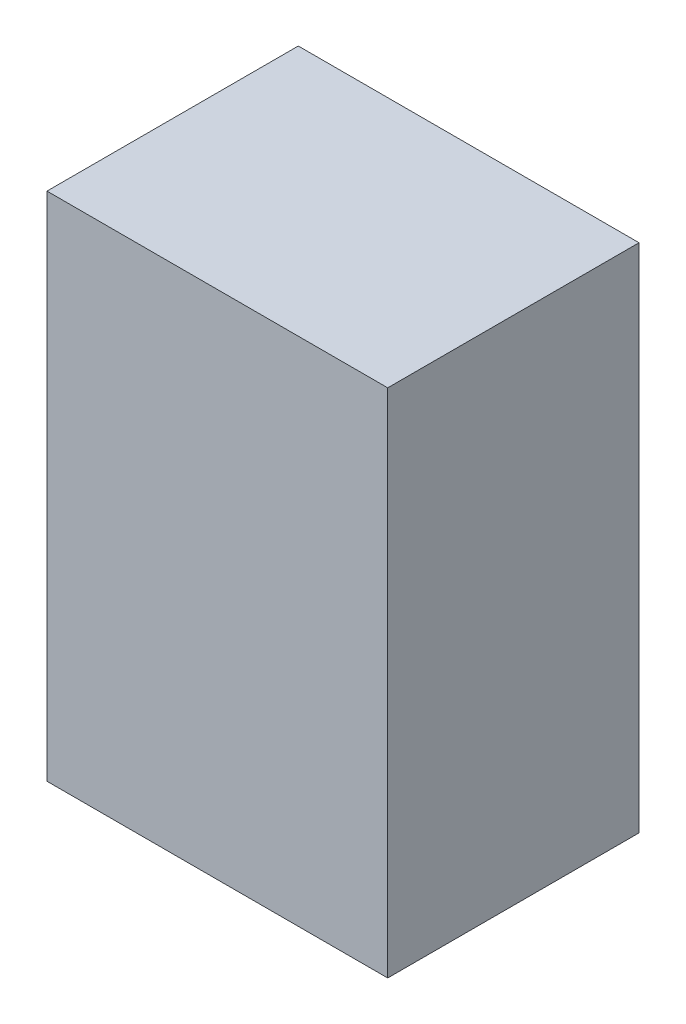
ISO-10303-21;
HEADER;
FILE_DESCRIPTION(('STEP AP214'),'2;1');
FILE_NAME('part.step','',(''),(''),'','','');
FILE_SCHEMA(('AUTOMOTIVE_DESIGN { 1 0 10303 214 1 1 1 1 }'));
ENDSEC;
DATA;
#1=APPLICATION_CONTEXT('core data for automotive mechanical design processes');
#2=APPLICATION_PROTOCOL_DEFINITION('international standard','automotive_design',2000,#1);
#3=PRODUCT_CONTEXT('',#1,'mechanical');
#4=PRODUCT('Part','Part','',(#3));
#5=PRODUCT_RELATED_PRODUCT_CATEGORY('part','',(#4));
#6=PRODUCT_DEFINITION_FORMATION('','',#4);
#7=PRODUCT_DEFINITION_CONTEXT('part definition',#1,'design');
#8=PRODUCT_DEFINITION('design','',#6,#7);
#9=PRODUCT_DEFINITION_SHAPE('','',#8);
#10=(LENGTH_UNIT() NAMED_UNIT(*) SI_UNIT(.MILLI.,.METRE.));
#11=(NAMED_UNIT(*) PLANE_ANGLE_UNIT() SI_UNIT($,.RADIAN.));
#12=(NAMED_UNIT(*) SI_UNIT($,.STERADIAN.) SOLID_ANGLE_UNIT());
#13=UNCERTAINTY_MEASURE_WITH_UNIT(LENGTH_MEASURE(1.E-05),#10,'distance_accuracy_value','');
#14=(GEOMETRIC_REPRESENTATION_CONTEXT(3) GLOBAL_UNCERTAINTY_ASSIGNED_CONTEXT((#13)) GLOBAL_UNIT_ASSIGNED_CONTEXT((#10,
#11,#12)) REPRESENTATION_CONTEXT('',''));
#15=CARTESIAN_POINT('',(0.,0.,0.));
#16=DIRECTION('',(0.,0.,1.));
#17=DIRECTION('',(1.,0.,0.));
#18=AXIS2_PLACEMENT_3D('',#15,#16,#17);
#19=CARTESIAN_POINT('',(-0.3999992,-0.5999988,0.58999882));
#20=DIRECTION('',(0.,0.,-1.));
#21=DIRECTION('',(-1.,0.,0.));
#22=AXIS2_PLACEMENT_3D('',#19,#20,#21);
#23=PLANE('',#22);
#24=DIRECTION('',(0.,1.,0.));
#25=VECTOR('',#24,1.);
#26=CARTESIAN_POINT('',(0.3999992,-0.5999988,0.58999882));
#27=LINE('',#26,#25);
#28=CARTESIAN_POINT('',(0.3999992,-0.5999988,0.58999882));
#29=VERTEX_POINT('',#28);
#30=CARTESIAN_POINT('',(0.3999992,0.60000134,0.58999882));
#31=VERTEX_POINT('',#30);
#32=EDGE_CURVE('E54',#29,#31,#27,.T.);
#33=ORIENTED_EDGE('',*,*,#32,.T.);
#34=DIRECTION('',(1.,0.,0.));
#35=VECTOR('',#34,1.);
#36=CARTESIAN_POINT('',(0.3999992,0.60000134,0.58999882));
#37=LINE('',#36,#35);
#38=CARTESIAN_POINT('',(-0.3999992,0.60000134,0.58999882));
#39=VERTEX_POINT('',#38);
#40=EDGE_CURVE('E56',#31,#39,#37,.F.);
#41=ORIENTED_EDGE('',*,*,#40,.T.);
#42=DIRECTION('',(0.,1.,0.));
#43=VECTOR('',#42,1.);
#44=CARTESIAN_POINT('',(-0.3999992,0.60000134,0.58999882));
#45=LINE('',#44,#43);
#46=CARTESIAN_POINT('',(-0.3999992,-0.5999988,0.58999882));
#47=VERTEX_POINT('',#46);
#48=EDGE_CURVE('E19',#39,#47,#45,.F.);
#49=ORIENTED_EDGE('',*,*,#48,.T.);
#50=DIRECTION('',(1.,0.,0.));
#51=VECTOR('',#50,1.);
#52=CARTESIAN_POINT('',(-0.3999992,-0.5999988,0.58999882));
#53=LINE('',#52,#51);
#54=EDGE_CURVE('E79',#47,#29,#53,.T.);
#55=ORIENTED_EDGE('',*,*,#54,.T.);
#56=EDGE_LOOP('',(#33,#41,#49,#55));
#57=FACE_BOUND('',#56,.T.);
#58=ADVANCED_FACE('F16',(#57),#23,.F.);
#59=CARTESIAN_POINT('',(-0.3999992,0.60000134,0.));
#60=DIRECTION('',(1.,0.,0.));
#61=DIRECTION('',(0.,0.,-1.));
#62=AXIS2_PLACEMENT_3D('',#59,#60,#61);
#63=PLANE('',#62);
#64=DIRECTION('',(0.,0.,1.));
#65=VECTOR('',#64,1.);
#66=CARTESIAN_POINT('',(-0.3999992,-0.5999988,0.));
#67=LINE('',#66,#65);
#68=CARTESIAN_POINT('',(-0.3999992,-0.5999988,0.));
#69=VERTEX_POINT('',#68);
#70=EDGE_CURVE('E67',#69,#47,#67,.T.);
#71=ORIENTED_EDGE('',*,*,#70,.T.);
#72=ORIENTED_EDGE('',*,*,#48,.F.);
#73=DIRECTION('',(0.,0.,-1.));
#74=VECTOR('',#73,1.);
#75=CARTESIAN_POINT('',(-0.3999992,0.60000134,0.));
#76=LINE('',#75,#74);
#77=CARTESIAN_POINT('',(-0.3999992,0.60000134,0.));
#78=VERTEX_POINT('',#77);
#79=EDGE_CURVE('E62',#39,#78,#76,.T.);
#80=ORIENTED_EDGE('',*,*,#79,.T.);
#81=DIRECTION('',(0.,1.,0.));
#82=VECTOR('',#81,1.);
#83=CARTESIAN_POINT('',(-0.3999992,-0.5999988,0.));
#84=LINE('',#83,#82);
#85=EDGE_CURVE('E82',#69,#78,#84,.T.);
#86=ORIENTED_EDGE('',*,*,#85,.F.);
#87=EDGE_LOOP('',(#71,#72,#80,#86));
#88=FACE_BOUND('',#87,.T.);
#89=ADVANCED_FACE('F64',(#88),#63,.F.);
#90=CARTESIAN_POINT('',(0.3999992,0.60000134,0.));
#91=DIRECTION('',(0.,-1.,0.));
#92=DIRECTION('',(0.,0.,-1.));
#93=AXIS2_PLACEMENT_3D('',#90,#91,#92);
#94=PLANE('',#93);
#95=ORIENTED_EDGE('',*,*,#79,.F.);
#96=ORIENTED_EDGE('',*,*,#40,.F.);
#97=DIRECTION('',(0.,0.,1.));
#98=VECTOR('',#97,1.);
#99=CARTESIAN_POINT('',(0.3999992,0.60000134,0.));
#100=LINE('',#99,#98);
#101=CARTESIAN_POINT('',(0.3999992,0.60000134,0.));
#102=VERTEX_POINT('',#101);
#103=EDGE_CURVE('E74',#31,#102,#100,.F.);
#104=ORIENTED_EDGE('',*,*,#103,.T.);
#105=DIRECTION('',(-1.,0.,0.));
#106=VECTOR('',#105,1.);
#107=CARTESIAN_POINT('',(-0.3999992,0.60000134,0.));
#108=LINE('',#107,#106);
#109=EDGE_CURVE('E71',#78,#102,#108,.F.);
#110=ORIENTED_EDGE('',*,*,#109,.F.);
#111=EDGE_LOOP('',(#95,#96,#104,#110));
#112=FACE_BOUND('',#111,.T.);
#113=ADVANCED_FACE('F69',(#112),#94,.F.);
#114=CARTESIAN_POINT('',(0.3999992,-0.5999988,0.));
#115=DIRECTION('',(-1.,0.,0.));
#116=DIRECTION('',(0.,0.,1.));
#117=AXIS2_PLACEMENT_3D('',#114,#115,#116);
#118=PLANE('',#117);
#119=ORIENTED_EDGE('',*,*,#103,.F.);
#120=ORIENTED_EDGE('',*,*,#32,.F.);
#121=DIRECTION('',(0.,0.,1.));
#122=VECTOR('',#121,1.);
#123=CARTESIAN_POINT('',(0.3999992,-0.5999988,0.));
#124=LINE('',#123,#122);
#125=CARTESIAN_POINT('',(0.3999992,-0.5999988,0.));
#126=VERTEX_POINT('',#125);
#127=EDGE_CURVE('E34',#29,#126,#124,.F.);
#128=ORIENTED_EDGE('',*,*,#127,.T.);
#129=DIRECTION('',(0.,1.,0.));
#130=VECTOR('',#129,1.);
#131=CARTESIAN_POINT('',(0.3999992,-0.5999988,0.));
#132=LINE('',#131,#130);
#133=EDGE_CURVE('E25',#102,#126,#132,.F.);
#134=ORIENTED_EDGE('',*,*,#133,.F.);
#135=EDGE_LOOP('',(#119,#120,#128,#134));
#136=FACE_BOUND('',#135,.T.);
#137=ADVANCED_FACE('F88',(#136),#118,.F.);
#138=CARTESIAN_POINT('',(-0.3999992,-0.5999988,0.));
#139=DIRECTION('',(0.,1.,0.));
#140=DIRECTION('',(0.,0.,1.));
#141=AXIS2_PLACEMENT_3D('',#138,#139,#140);
#142=PLANE('',#141);
#143=ORIENTED_EDGE('',*,*,#127,.F.);
#144=ORIENTED_EDGE('',*,*,#54,.F.);
#145=ORIENTED_EDGE('',*,*,#70,.F.);
#146=DIRECTION('',(-1.,0.,0.));
#147=VECTOR('',#146,1.);
#148=CARTESIAN_POINT('',(-0.3999992,-0.5999988,0.));
#149=LINE('',#148,#147);
#150=EDGE_CURVE('E11',#126,#69,#149,.T.);
#151=ORIENTED_EDGE('',*,*,#150,.F.);
#152=EDGE_LOOP('',(#143,#144,#145,#151));
#153=FACE_BOUND('',#152,.T.);
#154=ADVANCED_FACE('F90',(#153),#142,.F.);
#155=CARTESIAN_POINT('',(-0.3999992,-0.5999988,0.));
#156=DIRECTION('',(0.,0.,-1.));
#157=DIRECTION('',(-1.,0.,0.));
#158=AXIS2_PLACEMENT_3D('',#155,#156,#157);
#159=PLANE('',#158);
#160=ORIENTED_EDGE('',*,*,#133,.T.);
#161=ORIENTED_EDGE('',*,*,#150,.T.);
#162=ORIENTED_EDGE('',*,*,#85,.T.);
#163=ORIENTED_EDGE('',*,*,#109,.T.);
#164=EDGE_LOOP('',(#160,#161,#162,#163));
#165=FACE_BOUND('',#164,.T.);
#166=ADVANCED_FACE('F87',(#165),#159,.T.);
#167=CLOSED_SHELL('',(#58,#89,#113,#137,#154,#166));
#168=MANIFOLD_SOLID_BREP('B1',#167);
#169=ADVANCED_BREP_SHAPE_REPRESENTATION('',(#18,#168),#14);
#170=SHAPE_DEFINITION_REPRESENTATION(#9,#169);
ENDSEC;
END-ISO-10303-21;
